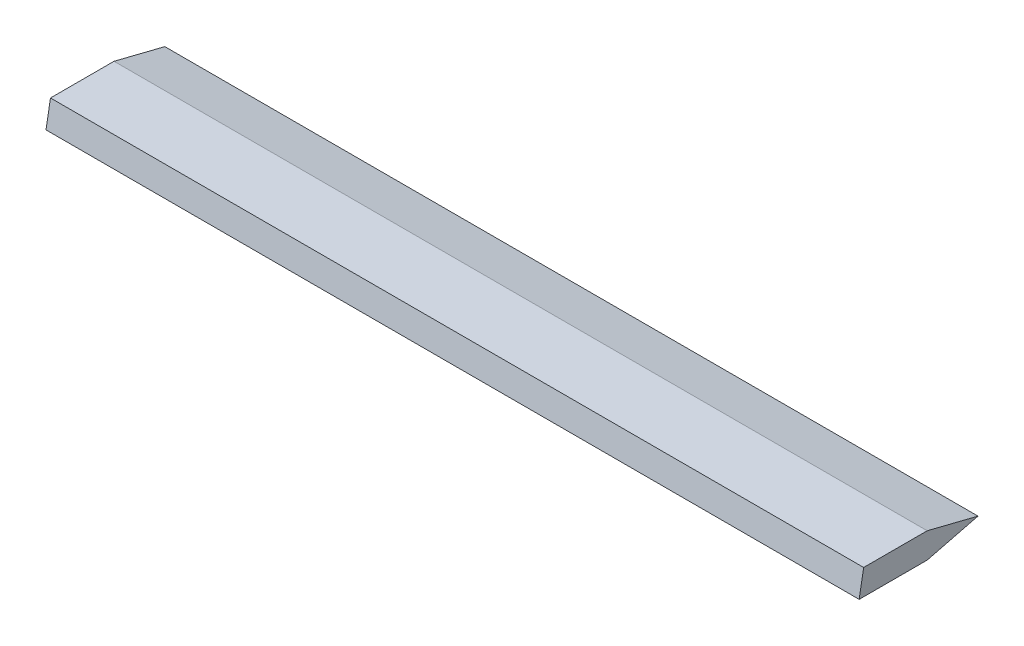
ISO-10303-21;
HEADER;
FILE_DESCRIPTION(('STEP AP214'),'2;1');
FILE_NAME('part.step','',(''),(''),'','','');
FILE_SCHEMA(('AUTOMOTIVE_DESIGN { 1 0 10303 214 1 1 1 1 }'));
ENDSEC;
DATA;
#1=APPLICATION_CONTEXT('core data for automotive mechanical design processes');
#2=APPLICATION_PROTOCOL_DEFINITION('international standard','automotive_design',2000,#1);
#3=PRODUCT_CONTEXT('',#1,'mechanical');
#4=PRODUCT('Part','Part','',(#3));
#5=PRODUCT_RELATED_PRODUCT_CATEGORY('part','',(#4));
#6=PRODUCT_DEFINITION_FORMATION('','',#4);
#7=PRODUCT_DEFINITION_CONTEXT('part definition',#1,'design');
#8=PRODUCT_DEFINITION('design','',#6,#7);
#9=PRODUCT_DEFINITION_SHAPE('','',#8);
#10=(LENGTH_UNIT() NAMED_UNIT(*) SI_UNIT(.MILLI.,.METRE.));
#11=(NAMED_UNIT(*) PLANE_ANGLE_UNIT() SI_UNIT($,.RADIAN.));
#12=(NAMED_UNIT(*) SI_UNIT($,.STERADIAN.) SOLID_ANGLE_UNIT());
#13=UNCERTAINTY_MEASURE_WITH_UNIT(LENGTH_MEASURE(1.E-05),#10,'distance_accuracy_value','');
#14=(GEOMETRIC_REPRESENTATION_CONTEXT(3) GLOBAL_UNCERTAINTY_ASSIGNED_CONTEXT((#13)) GLOBAL_UNIT_ASSIGNED_CONTEXT((#10,
#11,#12)) REPRESENTATION_CONTEXT('',''));
#15=CARTESIAN_POINT('',(0.,0.,0.));
#16=DIRECTION('',(0.,0.,1.));
#17=DIRECTION('',(1.,0.,0.));
#18=AXIS2_PLACEMENT_3D('',#15,#16,#17);
#19=CARTESIAN_POINT('',(81.28,-2.54,0.447870530999483));
#20=DIRECTION('',(0.,-0.173648177666923,-0.984807753012209));
#21=DIRECTION('',(0.,0.984807753012209,-0.173648177666923));
#22=AXIS2_PLACEMENT_3D('',#19,#20,#21);
#23=PLANE('',#22);
#24=DIRECTION('',(0.,-0.984807753012209,0.173648177666923));
#25=VECTOR('',#24,1.);
#26=CARTESIAN_POINT('',(0.,-2.54,0.447870530999483));
#27=LINE('',#26,#25);
#28=CARTESIAN_POINT('',(0.,0.,0.));
#29=VERTEX_POINT('',#28);
#30=CARTESIAN_POINT('',(0.,-2.54,0.447870530999483));
#31=VERTEX_POINT('',#30);
#32=EDGE_CURVE('E107',#29,#31,#27,.T.);
#33=ORIENTED_EDGE('',*,*,#32,.T.);
#34=DIRECTION('',(-1.,0.,0.));
#35=VECTOR('',#34,1.);
#36=CARTESIAN_POINT('',(81.28,-2.54,0.447870530999483));
#37=LINE('',#36,#35);
#38=CARTESIAN_POINT('',(81.28,-2.54,0.447870530999483));
#39=VERTEX_POINT('',#38);
#40=EDGE_CURVE('E11',#39,#31,#37,.T.);
#41=ORIENTED_EDGE('',*,*,#40,.F.);
#42=DIRECTION('',(0.,-0.984807753012209,0.173648177666923));
#43=VECTOR('',#42,1.);
#44=CARTESIAN_POINT('',(81.28,-2.54,0.447870530999483));
#45=LINE('',#44,#43);
#46=CARTESIAN_POINT('',(81.28,0.,0.));
#47=VERTEX_POINT('',#46);
#48=EDGE_CURVE('E115',#47,#39,#45,.T.);
#49=ORIENTED_EDGE('',*,*,#48,.F.);
#50=DIRECTION('',(-1.,0.,0.));
#51=VECTOR('',#50,1.);
#52=CARTESIAN_POINT('',(81.28,0.,0.));
#53=LINE('',#52,#51);
#54=EDGE_CURVE('E103',#47,#29,#53,.T.);
#55=ORIENTED_EDGE('',*,*,#54,.T.);
#56=EDGE_LOOP('',(#33,#41,#49,#55));
#57=FACE_BOUND('',#56,.T.);
#58=ADVANCED_FACE('F33',(#57),#23,.F.);
#59=CARTESIAN_POINT('',(81.28,-2.54,-6.35));
#60=DIRECTION('',(0.,1.,0.));
#61=DIRECTION('',(0.,0.,1.));
#62=AXIS2_PLACEMENT_3D('',#59,#60,#61);
#63=PLANE('',#62);
#64=DIRECTION('',(0.,0.,-1.));
#65=VECTOR('',#64,1.);
#66=CARTESIAN_POINT('',(0.,-2.54,-6.35));
#67=LINE('',#66,#65);
#68=CARTESIAN_POINT('',(0.,-2.54,-6.35));
#69=VERTEX_POINT('',#68);
#70=EDGE_CURVE('E110',#31,#69,#67,.T.);
#71=ORIENTED_EDGE('',*,*,#70,.T.);
#72=DIRECTION('',(-1.,0.,0.));
#73=VECTOR('',#72,1.);
#74=CARTESIAN_POINT('',(81.28,-2.54,-6.35));
#75=LINE('',#74,#73);
#76=CARTESIAN_POINT('',(81.28,-2.54,-6.35));
#77=VERTEX_POINT('',#76);
#78=EDGE_CURVE('E41',#77,#69,#75,.T.);
#79=ORIENTED_EDGE('',*,*,#78,.F.);
#80=DIRECTION('',(0.,0.,-1.));
#81=VECTOR('',#80,1.);
#82=CARTESIAN_POINT('',(81.28,-2.54,-6.35));
#83=LINE('',#82,#81);
#84=EDGE_CURVE('E83',#39,#77,#83,.T.);
#85=ORIENTED_EDGE('',*,*,#84,.F.);
#86=ORIENTED_EDGE('',*,*,#40,.T.);
#87=EDGE_LOOP('',(#71,#79,#85,#86));
#88=FACE_BOUND('',#87,.T.);
#89=ADVANCED_FACE('F134',(#88),#63,.F.);
#90=CARTESIAN_POINT('',(81.28,-1.27,-11.43));
#91=DIRECTION('',(0.,0.970142500145332,0.242535625036333));
#92=DIRECTION('',(0.,-0.242535625036333,0.970142500145332));
#93=AXIS2_PLACEMENT_3D('',#90,#91,#92);
#94=PLANE('',#93);
#95=DIRECTION('',(0.,0.242535625036333,-0.970142500145332));
#96=VECTOR('',#95,1.);
#97=CARTESIAN_POINT('',(0.,-1.27,-11.43));
#98=LINE('',#97,#96);
#99=CARTESIAN_POINT('',(0.,-1.27,-11.43));
#100=VERTEX_POINT('',#99);
#101=EDGE_CURVE('E98',#69,#100,#98,.T.);
#102=ORIENTED_EDGE('',*,*,#101,.T.);
#103=DIRECTION('',(-1.,0.,0.));
#104=VECTOR('',#103,1.);
#105=CARTESIAN_POINT('',(81.28,-1.27,-11.43));
#106=LINE('',#105,#104);
#107=CARTESIAN_POINT('',(81.28,-1.27,-11.43));
#108=VERTEX_POINT('',#107);
#109=EDGE_CURVE('E95',#108,#100,#106,.T.);
#110=ORIENTED_EDGE('',*,*,#109,.F.);
#111=DIRECTION('',(0.,0.242535625036333,-0.970142500145332));
#112=VECTOR('',#111,1.);
#113=CARTESIAN_POINT('',(81.28,-1.27,-11.43));
#114=LINE('',#113,#112);
#115=EDGE_CURVE('E87',#77,#108,#114,.T.);
#116=ORIENTED_EDGE('',*,*,#115,.F.);
#117=ORIENTED_EDGE('',*,*,#78,.T.);
#118=EDGE_LOOP('',(#102,#110,#116,#117));
#119=FACE_BOUND('',#118,.T.);
#120=ADVANCED_FACE('F96',(#119),#94,.F.);
#121=CARTESIAN_POINT('',(81.28,0.,-6.35));
#122=DIRECTION('',(0.,-0.970142500145332,0.242535625036333));
#123=DIRECTION('',(0.,-0.242535625036333,-0.970142500145332));
#124=AXIS2_PLACEMENT_3D('',#121,#122,#123);
#125=PLANE('',#124);
#126=DIRECTION('',(0.,0.242535625036333,0.970142500145332));
#127=VECTOR('',#126,1.);
#128=CARTESIAN_POINT('',(0.,0.,-6.35));
#129=LINE('',#128,#127);
#130=CARTESIAN_POINT('',(0.,0.,-6.35));
#131=VERTEX_POINT('',#130);
#132=EDGE_CURVE('E69',#100,#131,#129,.T.);
#133=ORIENTED_EDGE('',*,*,#132,.T.);
#134=DIRECTION('',(-1.,0.,0.));
#135=VECTOR('',#134,1.);
#136=CARTESIAN_POINT('',(81.28,0.,-6.35));
#137=LINE('',#136,#135);
#138=CARTESIAN_POINT('',(81.28,0.,-6.35));
#139=VERTEX_POINT('',#138);
#140=EDGE_CURVE('E99',#139,#131,#137,.T.);
#141=ORIENTED_EDGE('',*,*,#140,.F.);
#142=DIRECTION('',(0.,0.242535625036333,0.970142500145332));
#143=VECTOR('',#142,1.);
#144=CARTESIAN_POINT('',(81.28,0.,-6.35));
#145=LINE('',#144,#143);
#146=EDGE_CURVE('E91',#108,#139,#145,.T.);
#147=ORIENTED_EDGE('',*,*,#146,.F.);
#148=ORIENTED_EDGE('',*,*,#109,.T.);
#149=EDGE_LOOP('',(#133,#141,#147,#148));
#150=FACE_BOUND('',#149,.T.);
#151=ADVANCED_FACE('F101',(#150),#125,.F.);
#152=CARTESIAN_POINT('',(81.28,0.,0.));
#153=DIRECTION('',(0.,-1.,0.));
#154=DIRECTION('',(0.,0.,-1.));
#155=AXIS2_PLACEMENT_3D('',#152,#153,#154);
#156=PLANE('',#155);
#157=DIRECTION('',(0.,0.,1.));
#158=VECTOR('',#157,1.);
#159=CARTESIAN_POINT('',(0.,0.,0.));
#160=LINE('',#159,#158);
#161=EDGE_CURVE('E75',#131,#29,#160,.T.);
#162=ORIENTED_EDGE('',*,*,#161,.T.);
#163=ORIENTED_EDGE('',*,*,#54,.F.);
#164=DIRECTION('',(0.,0.,1.));
#165=VECTOR('',#164,1.);
#166=CARTESIAN_POINT('',(81.28,0.,0.));
#167=LINE('',#166,#165);
#168=EDGE_CURVE('E49',#139,#47,#167,.T.);
#169=ORIENTED_EDGE('',*,*,#168,.F.);
#170=ORIENTED_EDGE('',*,*,#140,.T.);
#171=EDGE_LOOP('',(#162,#163,#169,#170));
#172=FACE_BOUND('',#171,.T.);
#173=ADVANCED_FACE('F123',(#172),#156,.F.);
#174=CARTESIAN_POINT('',(81.28,0.,0.));
#175=DIRECTION('',(-1.,0.,0.));
#176=DIRECTION('',(0.,0.,1.));
#177=AXIS2_PLACEMENT_3D('',#174,#175,#176);
#178=PLANE('',#177);
#179=ORIENTED_EDGE('',*,*,#48,.T.);
#180=ORIENTED_EDGE('',*,*,#84,.T.);
#181=ORIENTED_EDGE('',*,*,#115,.T.);
#182=ORIENTED_EDGE('',*,*,#146,.T.);
#183=ORIENTED_EDGE('',*,*,#168,.T.);
#184=EDGE_LOOP('',(#179,#180,#181,#182,#183));
#185=FACE_BOUND('',#184,.T.);
#186=ADVANCED_FACE('F89',(#185),#178,.F.);
#187=CARTESIAN_POINT('',(0.,0.,0.));
#188=DIRECTION('',(-1.,0.,0.));
#189=DIRECTION('',(0.,0.,1.));
#190=AXIS2_PLACEMENT_3D('',#187,#188,#189);
#191=PLANE('',#190);
#192=ORIENTED_EDGE('',*,*,#32,.F.);
#193=ORIENTED_EDGE('',*,*,#161,.F.);
#194=ORIENTED_EDGE('',*,*,#132,.F.);
#195=ORIENTED_EDGE('',*,*,#101,.F.);
#196=ORIENTED_EDGE('',*,*,#70,.F.);
#197=EDGE_LOOP('',(#192,#193,#194,#195,#196));
#198=FACE_BOUND('',#197,.T.);
#199=ADVANCED_FACE('F119',(#198),#191,.T.);
#200=CLOSED_SHELL('',(#58,#89,#120,#151,#173,#186,#199));
#201=MANIFOLD_SOLID_BREP('B2',#200);
#202=ADVANCED_BREP_SHAPE_REPRESENTATION('',(#18,#201),#14);
#203=SHAPE_DEFINITION_REPRESENTATION(#9,#202);
ENDSEC;
END-ISO-10303-21;
